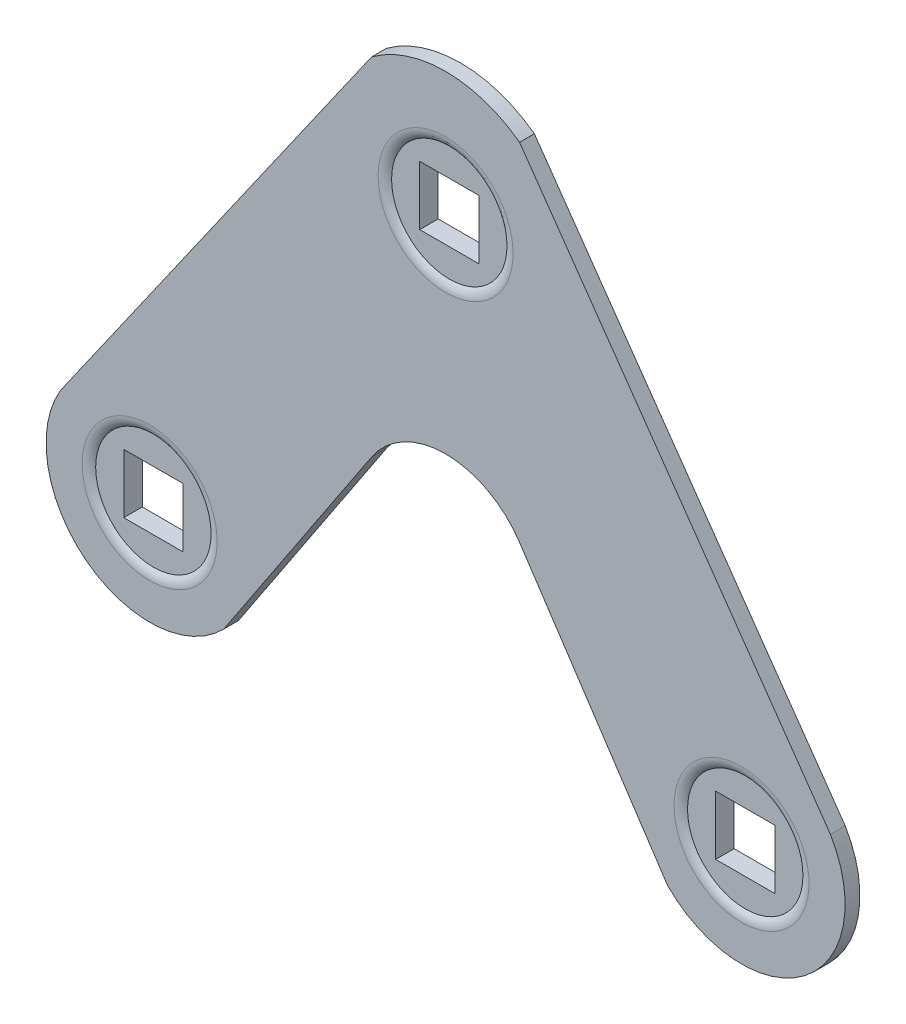
ISO-10303-21;
HEADER;
FILE_DESCRIPTION(('STEP AP214'),'2;1');
FILE_NAME('part.step','',(''),(''),'','','');
FILE_SCHEMA(('AUTOMOTIVE_DESIGN { 1 0 10303 214 1 1 1 1 }'));
ENDSEC;
DATA;
#1=APPLICATION_CONTEXT('core data for automotive mechanical design processes');
#2=APPLICATION_PROTOCOL_DEFINITION('international standard','automotive_design',2000,#1);
#3=PRODUCT_CONTEXT('',#1,'mechanical');
#4=PRODUCT('Part','Part','',(#3));
#5=PRODUCT_RELATED_PRODUCT_CATEGORY('part','',(#4));
#6=PRODUCT_DEFINITION_FORMATION('','',#4);
#7=PRODUCT_DEFINITION_CONTEXT('part definition',#1,'design');
#8=PRODUCT_DEFINITION('design','',#6,#7);
#9=PRODUCT_DEFINITION_SHAPE('','',#8);
#10=(LENGTH_UNIT() NAMED_UNIT(*) SI_UNIT(.MILLI.,.METRE.));
#11=(NAMED_UNIT(*) PLANE_ANGLE_UNIT() SI_UNIT($,.RADIAN.));
#12=(NAMED_UNIT(*) SI_UNIT($,.STERADIAN.) SOLID_ANGLE_UNIT());
#13=UNCERTAINTY_MEASURE_WITH_UNIT(LENGTH_MEASURE(1.E-05),#10,'distance_accuracy_value','');
#14=(GEOMETRIC_REPRESENTATION_CONTEXT(3) GLOBAL_UNCERTAINTY_ASSIGNED_CONTEXT((#13)) GLOBAL_UNIT_ASSIGNED_CONTEXT((#10,
#11,#12)) REPRESENTATION_CONTEXT('',''));
#15=CARTESIAN_POINT('',(0.,0.,0.));
#16=DIRECTION('',(0.,0.,1.));
#17=DIRECTION('',(1.,0.,0.));
#18=AXIS2_PLACEMENT_3D('',#15,#16,#17);
#19=CARTESIAN_POINT('',(0.,9.,0.));
#20=DIRECTION('',(0.,0.,-1.));
#21=DIRECTION('',(-1.,0.,0.));
#22=AXIS2_PLACEMENT_3D('',#19,#20,#21);
#23=PLANE('',#22);
#24=CARTESIAN_POINT('',(20.,2.14003704703357,0.));
#25=DIRECTION('',(0.,0.,-1.));
#26=DIRECTION('',(-1.,0.,0.));
#27=AXIS2_PLACEMENT_3D('',#24,#25,#26);
#28=CIRCLE('',#27,4.25);
#29=CARTESIAN_POINT('',(15.75,2.14003704703357,0.));
#30=VERTEX_POINT('',#29);
#31=EDGE_CURVE('E235',#30,#30,#28,.T.);
#32=ORIENTED_EDGE('',*,*,#31,.F.);
#33=EDGE_LOOP('',(#32));
#34=FACE_BOUND('',#33,.T.);
#35=CARTESIAN_POINT('',(0.,9.,0.));
#36=DIRECTION('',(0.,0.,-1.));
#37=DIRECTION('',(-1.,0.,0.));
#38=AXIS2_PLACEMENT_3D('',#35,#36,#37);
#39=CIRCLE('',#38,6.);
#40=CARTESIAN_POINT('',(-5.,12.3166247903554,0.));
#41=VERTEX_POINT('',#40);
#42=CARTESIAN_POINT('',(5.,12.3166247903554,0.));
#43=VERTEX_POINT('',#42);
#44=EDGE_CURVE('E313',#41,#43,#39,.T.);
#45=ORIENTED_EDGE('',*,*,#44,.F.);
#46=DIRECTION('',(0.552770798392567,0.833333333333333,0.));
#47=VECTOR('',#46,1.);
#48=CARTESIAN_POINT('',(-5.,12.3166247903554,0.));
#49=LINE('',#48,#47);
#50=CARTESIAN_POINT('',(-15.,-2.75894243853278,0.));
#51=VERTEX_POINT('',#50);
#52=EDGE_CURVE('E326',#51,#41,#49,.T.);
#53=ORIENTED_EDGE('',*,*,#52,.F.);
#54=CARTESIAN_POINT('',(-20.,2.14003704703357,0.));
#55=DIRECTION('',(0.,0.,1.));
#56=DIRECTION('',(-1.,0.,0.));
#57=AXIS2_PLACEMENT_3D('',#54,#55,#56);
#58=CIRCLE('',#57,7.);
#59=CARTESIAN_POINT('',(-26.0062261462914,5.73520706799309,0.));
#60=VERTEX_POINT('',#59);
#61=EDGE_CURVE('E366',#60,#51,#58,.T.);
#62=ORIENTED_EDGE('',*,*,#61,.F.);
#63=DIRECTION('',(-0.573576436351047,-0.819152044288991,0.));
#64=VECTOR('',#63,1.);
#65=CARTESIAN_POINT('',(-5.,35.7352070679931,0.));
#66=LINE('',#65,#64);
#67=CARTESIAN_POINT('',(-5.,35.7352070679931,0.));
#68=VERTEX_POINT('',#67);
#69=EDGE_CURVE('E363',#68,#60,#66,.T.);
#70=ORIENTED_EDGE('',*,*,#69,.F.);
#71=CARTESIAN_POINT('',(0.,29.,0.));
#72=DIRECTION('',(0.,0.,1.));
#73=DIRECTION('',(-1.,0.,0.));
#74=AXIS2_PLACEMENT_3D('',#71,#72,#73);
#75=CIRCLE('',#74,8.3882664626694);
#76=CARTESIAN_POINT('',(5.,35.7352070679931,0.));
#77=VERTEX_POINT('',#76);
#78=EDGE_CURVE('E360',#77,#68,#75,.T.);
#79=ORIENTED_EDGE('',*,*,#78,.F.);
#80=DIRECTION('',(-0.573576436351047,0.819152044288991,0.));
#81=VECTOR('',#80,1.);
#82=CARTESIAN_POINT('',(5.,35.7352070679931,0.));
#83=LINE('',#82,#81);
#84=CARTESIAN_POINT('',(26.0062261462914,5.73520706799309,0.));
#85=VERTEX_POINT('',#84);
#86=EDGE_CURVE('E357',#85,#77,#83,.T.);
#87=ORIENTED_EDGE('',*,*,#86,.F.);
#88=CARTESIAN_POINT('',(20.,2.14003704703357,0.));
#89=DIRECTION('',(0.,0.,1.));
#90=DIRECTION('',(1.,0.,0.));
#91=AXIS2_PLACEMENT_3D('',#88,#89,#90);
#92=CIRCLE('',#91,7.);
#93=CARTESIAN_POINT('',(15.,-2.75894243853278,0.));
#94=VERTEX_POINT('',#93);
#95=EDGE_CURVE('E354',#94,#85,#92,.T.);
#96=ORIENTED_EDGE('',*,*,#95,.F.);
#97=DIRECTION('',(0.552770798392567,-0.833333333333333,0.));
#98=VECTOR('',#97,1.);
#99=CARTESIAN_POINT('',(5.,12.3166247903554,0.));
#100=LINE('',#99,#98);
#101=EDGE_CURVE('E351',#43,#94,#100,.T.);
#102=ORIENTED_EDGE('',*,*,#101,.F.);
#103=EDGE_LOOP('',(#45,#53,#62,#70,#79,#87,#96,#102));
#104=FACE_BOUND('',#103,.T.);
#105=CARTESIAN_POINT('',(0.,29.,0.));
#106=DIRECTION('',(0.,0.,-1.));
#107=DIRECTION('',(-1.,0.,0.));
#108=AXIS2_PLACEMENT_3D('',#105,#106,#107);
#109=CIRCLE('',#108,4.25);
#110=CARTESIAN_POINT('',(-4.25,29.,0.));
#111=VERTEX_POINT('',#110);
#112=EDGE_CURVE('E208',#111,#111,#109,.T.);
#113=ORIENTED_EDGE('',*,*,#112,.F.);
#114=EDGE_LOOP('',(#113));
#115=FACE_BOUND('',#114,.T.);
#116=CARTESIAN_POINT('',(-20.,2.14003704703357,0.));
#117=DIRECTION('',(0.,0.,-1.));
#118=DIRECTION('',(-1.,0.,0.));
#119=AXIS2_PLACEMENT_3D('',#116,#117,#118);
#120=CIRCLE('',#119,4.25);
#121=CARTESIAN_POINT('',(-24.25,2.14003704703357,0.));
#122=VERTEX_POINT('',#121);
#123=EDGE_CURVE('E224',#122,#122,#120,.T.);
#124=ORIENTED_EDGE('',*,*,#123,.F.);
#125=EDGE_LOOP('',(#124));
#126=FACE_BOUND('',#125,.T.);
#127=ADVANCED_FACE('F56',(#34,#104,#115,#126),#23,.T.);
#128=CARTESIAN_POINT('',(0.,9.,1.));
#129=DIRECTION('',(0.,0.,-1.));
#130=DIRECTION('',(-1.,0.,0.));
#131=AXIS2_PLACEMENT_3D('',#128,#129,#130);
#132=CYLINDRICAL_SURFACE('',#131,6.);
#133=ORIENTED_EDGE('',*,*,#44,.T.);
#134=DIRECTION('',(0.,0.,-1.));
#135=VECTOR('',#134,1.);
#136=CARTESIAN_POINT('',(5.,12.3166247903554,1.));
#137=LINE('',#136,#135);
#138=CARTESIAN_POINT('',(5.,12.3166247903554,1.));
#139=VERTEX_POINT('',#138);
#140=EDGE_CURVE('E398',#139,#43,#137,.T.);
#141=ORIENTED_EDGE('',*,*,#140,.F.);
#142=CARTESIAN_POINT('',(0.,9.,1.));
#143=DIRECTION('',(0.,0.,-1.));
#144=DIRECTION('',(-1.,0.,0.));
#145=AXIS2_PLACEMENT_3D('',#142,#143,#144);
#146=CIRCLE('',#145,6.);
#147=CARTESIAN_POINT('',(-5.,12.3166247903554,1.));
#148=VERTEX_POINT('',#147);
#149=EDGE_CURVE('E321',#148,#139,#146,.T.);
#150=ORIENTED_EDGE('',*,*,#149,.F.);
#151=DIRECTION('',(0.,0.,-1.));
#152=VECTOR('',#151,1.);
#153=CARTESIAN_POINT('',(-5.,12.3166247903554,1.));
#154=LINE('',#153,#152);
#155=EDGE_CURVE('E347',#148,#41,#154,.T.);
#156=ORIENTED_EDGE('',*,*,#155,.T.);
#157=EDGE_LOOP('',(#133,#141,#150,#156));
#158=FACE_BOUND('',#157,.T.);
#159=ADVANCED_FACE('F470',(#158),#132,.F.);
#160=CARTESIAN_POINT('',(5.,12.3166247903554,1.));
#161=DIRECTION('',(0.833333333333333,0.552770798392567,0.));
#162=DIRECTION('',(-0.552770798392567,0.833333333333333,0.));
#163=AXIS2_PLACEMENT_3D('',#160,#161,#162);
#164=PLANE('',#163);
#165=ORIENTED_EDGE('',*,*,#101,.T.);
#166=DIRECTION('',(0.,0.,-1.));
#167=VECTOR('',#166,1.);
#168=CARTESIAN_POINT('',(15.,-2.75894243853278,1.));
#169=LINE('',#168,#167);
#170=CARTESIAN_POINT('',(15.,-2.75894243853278,1.));
#171=VERTEX_POINT('',#170);
#172=EDGE_CURVE('E394',#171,#94,#169,.T.);
#173=ORIENTED_EDGE('',*,*,#172,.F.);
#174=DIRECTION('',(0.552770798392567,-0.833333333333333,0.));
#175=VECTOR('',#174,1.);
#176=CARTESIAN_POINT('',(5.,12.3166247903554,1.));
#177=LINE('',#176,#175);
#178=EDGE_CURVE('E325',#139,#171,#177,.T.);
#179=ORIENTED_EDGE('',*,*,#178,.F.);
#180=ORIENTED_EDGE('',*,*,#140,.T.);
#181=EDGE_LOOP('',(#165,#173,#179,#180));
#182=FACE_BOUND('',#181,.T.);
#183=ADVANCED_FACE('F476',(#182),#164,.F.);
#184=CARTESIAN_POINT('',(20.,2.14003704703357,1.));
#185=DIRECTION('',(0.,0.,-1.));
#186=DIRECTION('',(-1.,0.,0.));
#187=AXIS2_PLACEMENT_3D('',#184,#185,#186);
#188=CYLINDRICAL_SURFACE('',#187,7.);
#189=ORIENTED_EDGE('',*,*,#95,.T.);
#190=DIRECTION('',(0.,0.,-1.));
#191=VECTOR('',#190,1.);
#192=CARTESIAN_POINT('',(26.0062261462914,5.73520706799309,1.));
#193=LINE('',#192,#191);
#194=CARTESIAN_POINT('',(26.0062261462914,5.73520706799309,1.));
#195=VERTEX_POINT('',#194);
#196=EDGE_CURVE('E390',#195,#85,#193,.T.);
#197=ORIENTED_EDGE('',*,*,#196,.F.);
#198=CARTESIAN_POINT('',(20.,2.14003704703357,1.));
#199=DIRECTION('',(0.,0.,1.));
#200=DIRECTION('',(1.,0.,0.));
#201=AXIS2_PLACEMENT_3D('',#198,#199,#200);
#202=CIRCLE('',#201,7.);
#203=EDGE_CURVE('E329',#171,#195,#202,.T.);
#204=ORIENTED_EDGE('',*,*,#203,.F.);
#205=ORIENTED_EDGE('',*,*,#172,.T.);
#206=EDGE_LOOP('',(#189,#197,#204,#205));
#207=FACE_BOUND('',#206,.T.);
#208=ADVANCED_FACE('F504',(#207),#188,.T.);
#209=CARTESIAN_POINT('',(5.,35.7352070679931,1.));
#210=DIRECTION('',(-0.819152044288991,-0.573576436351047,0.));
#211=DIRECTION('',(0.573576436351047,-0.819152044288991,0.));
#212=AXIS2_PLACEMENT_3D('',#209,#210,#211);
#213=PLANE('',#212);
#214=ORIENTED_EDGE('',*,*,#86,.T.);
#215=DIRECTION('',(0.,0.,-1.));
#216=VECTOR('',#215,1.);
#217=CARTESIAN_POINT('',(5.,35.7352070679931,1.));
#218=LINE('',#217,#216);
#219=CARTESIAN_POINT('',(5.,35.7352070679931,1.));
#220=VERTEX_POINT('',#219);
#221=EDGE_CURVE('E386',#220,#77,#218,.T.);
#222=ORIENTED_EDGE('',*,*,#221,.F.);
#223=DIRECTION('',(-0.573576436351047,0.819152044288991,0.));
#224=VECTOR('',#223,1.);
#225=CARTESIAN_POINT('',(5.,35.7352070679931,1.));
#226=LINE('',#225,#224);
#227=EDGE_CURVE('E332',#195,#220,#226,.T.);
#228=ORIENTED_EDGE('',*,*,#227,.F.);
#229=ORIENTED_EDGE('',*,*,#196,.T.);
#230=EDGE_LOOP('',(#214,#222,#228,#229));
#231=FACE_BOUND('',#230,.T.);
#232=ADVANCED_FACE('F500',(#231),#213,.F.);
#233=CARTESIAN_POINT('',(0.,29.,1.));
#234=DIRECTION('',(0.,0.,-1.));
#235=DIRECTION('',(-1.,0.,0.));
#236=AXIS2_PLACEMENT_3D('',#233,#234,#235);
#237=CYLINDRICAL_SURFACE('',#236,8.3882664626694);
#238=ORIENTED_EDGE('',*,*,#78,.T.);
#239=DIRECTION('',(0.,0.,-1.));
#240=VECTOR('',#239,1.);
#241=CARTESIAN_POINT('',(-5.,35.7352070679931,1.));
#242=LINE('',#241,#240);
#243=CARTESIAN_POINT('',(-5.,35.7352070679931,1.));
#244=VERTEX_POINT('',#243);
#245=EDGE_CURVE('E382',#244,#68,#242,.T.);
#246=ORIENTED_EDGE('',*,*,#245,.F.);
#247=CARTESIAN_POINT('',(0.,29.,1.));
#248=DIRECTION('',(0.,0.,1.));
#249=DIRECTION('',(-1.,0.,0.));
#250=AXIS2_PLACEMENT_3D('',#247,#248,#249);
#251=CIRCLE('',#250,8.3882664626694);
#252=EDGE_CURVE('E335',#220,#244,#251,.T.);
#253=ORIENTED_EDGE('',*,*,#252,.F.);
#254=ORIENTED_EDGE('',*,*,#221,.T.);
#255=EDGE_LOOP('',(#238,#246,#253,#254));
#256=FACE_BOUND('',#255,.T.);
#257=ADVANCED_FACE('F496',(#256),#237,.T.);
#258=CARTESIAN_POINT('',(-5.,35.7352070679931,1.));
#259=DIRECTION('',(0.819152044288991,-0.573576436351047,0.));
#260=DIRECTION('',(0.573576436351047,0.819152044288991,0.));
#261=AXIS2_PLACEMENT_3D('',#258,#259,#260);
#262=PLANE('',#261);
#263=ORIENTED_EDGE('',*,*,#69,.T.);
#264=DIRECTION('',(0.,0.,-1.));
#265=VECTOR('',#264,1.);
#266=CARTESIAN_POINT('',(-26.0062261462914,5.73520706799309,1.));
#267=LINE('',#266,#265);
#268=CARTESIAN_POINT('',(-26.0062261462914,5.73520706799309,1.));
#269=VERTEX_POINT('',#268);
#270=EDGE_CURVE('E378',#269,#60,#267,.T.);
#271=ORIENTED_EDGE('',*,*,#270,.F.);
#272=DIRECTION('',(-0.573576436351047,-0.819152044288991,0.));
#273=VECTOR('',#272,1.);
#274=CARTESIAN_POINT('',(-5.,35.7352070679931,1.));
#275=LINE('',#274,#273);
#276=EDGE_CURVE('E338',#244,#269,#275,.T.);
#277=ORIENTED_EDGE('',*,*,#276,.F.);
#278=ORIENTED_EDGE('',*,*,#245,.T.);
#279=EDGE_LOOP('',(#263,#271,#277,#278));
#280=FACE_BOUND('',#279,.T.);
#281=ADVANCED_FACE('F492',(#280),#262,.F.);
#282=CARTESIAN_POINT('',(-20.,2.14003704703357,1.));
#283=DIRECTION('',(0.,0.,-1.));
#284=DIRECTION('',(-1.,0.,0.));
#285=AXIS2_PLACEMENT_3D('',#282,#283,#284);
#286=CYLINDRICAL_SURFACE('',#285,7.);
#287=ORIENTED_EDGE('',*,*,#61,.T.);
#288=DIRECTION('',(0.,0.,-1.));
#289=VECTOR('',#288,1.);
#290=CARTESIAN_POINT('',(-15.,-2.75894243853278,1.));
#291=LINE('',#290,#289);
#292=CARTESIAN_POINT('',(-15.,-2.75894243853278,1.));
#293=VERTEX_POINT('',#292);
#294=EDGE_CURVE('E374',#293,#51,#291,.T.);
#295=ORIENTED_EDGE('',*,*,#294,.F.);
#296=CARTESIAN_POINT('',(-20.,2.14003704703357,1.));
#297=DIRECTION('',(0.,0.,1.));
#298=DIRECTION('',(-1.,0.,0.));
#299=AXIS2_PLACEMENT_3D('',#296,#297,#298);
#300=CIRCLE('',#299,7.);
#301=EDGE_CURVE('E341',#269,#293,#300,.T.);
#302=ORIENTED_EDGE('',*,*,#301,.F.);
#303=ORIENTED_EDGE('',*,*,#270,.T.);
#304=EDGE_LOOP('',(#287,#295,#302,#303));
#305=FACE_BOUND('',#304,.T.);
#306=ADVANCED_FACE('F488',(#305),#286,.T.);
#307=CARTESIAN_POINT('',(-5.,12.3166247903554,1.));
#308=DIRECTION('',(-0.833333333333333,0.552770798392567,0.));
#309=DIRECTION('',(-0.552770798392567,-0.833333333333333,0.));
#310=AXIS2_PLACEMENT_3D('',#307,#308,#309);
#311=PLANE('',#310);
#312=ORIENTED_EDGE('',*,*,#52,.T.);
#313=ORIENTED_EDGE('',*,*,#155,.F.);
#314=DIRECTION('',(0.552770798392567,0.833333333333333,0.));
#315=VECTOR('',#314,1.);
#316=CARTESIAN_POINT('',(-5.,12.3166247903554,1.));
#317=LINE('',#316,#315);
#318=EDGE_CURVE('E344',#293,#148,#317,.T.);
#319=ORIENTED_EDGE('',*,*,#318,.F.);
#320=ORIENTED_EDGE('',*,*,#294,.T.);
#321=EDGE_LOOP('',(#312,#313,#319,#320));
#322=FACE_BOUND('',#321,.T.);
#323=ADVANCED_FACE('F485',(#322),#311,.F.);
#324=CARTESIAN_POINT('',(0.,9.,1.));
#325=DIRECTION('',(0.,0.,-1.));
#326=DIRECTION('',(-1.,0.,0.));
#327=AXIS2_PLACEMENT_3D('',#324,#325,#326);
#328=PLANE('',#327);
#329=CARTESIAN_POINT('',(-20.,2.14003704703357,1.));
#330=DIRECTION('',(0.,0.,-1.));
#331=DIRECTION('',(-1.,0.,0.));
#332=AXIS2_PLACEMENT_3D('',#329,#330,#331);
#333=CIRCLE('',#332,4.56143782776615);
#334=CARTESIAN_POINT('',(-24.5614378277661,2.14003704703357,1.));
#335=VERTEX_POINT('',#334);
#336=EDGE_CURVE('E410',#335,#335,#333,.T.);
#337=ORIENTED_EDGE('',*,*,#336,.T.);
#338=EDGE_LOOP('',(#337));
#339=FACE_BOUND('',#338,.T.);
#340=CARTESIAN_POINT('',(20.,2.14003704703357,1.));
#341=DIRECTION('',(0.,0.,-1.));
#342=DIRECTION('',(-1.,0.,0.));
#343=AXIS2_PLACEMENT_3D('',#340,#341,#342);
#344=CIRCLE('',#343,4.56143782776615);
#345=CARTESIAN_POINT('',(15.4385621722339,2.14003704703357,1.));
#346=VERTEX_POINT('',#345);
#347=EDGE_CURVE('E406',#346,#346,#344,.T.);
#348=ORIENTED_EDGE('',*,*,#347,.T.);
#349=EDGE_LOOP('',(#348));
#350=FACE_BOUND('',#349,.T.);
#351=CARTESIAN_POINT('',(0.,29.,1.));
#352=DIRECTION('',(0.,0.,-1.));
#353=DIRECTION('',(-1.,0.,0.));
#354=AXIS2_PLACEMENT_3D('',#351,#352,#353);
#355=CIRCLE('',#354,4.56143782776615);
#356=CARTESIAN_POINT('',(-4.56143782776615,29.,1.));
#357=VERTEX_POINT('',#356);
#358=EDGE_CURVE('E402',#357,#357,#355,.T.);
#359=ORIENTED_EDGE('',*,*,#358,.T.);
#360=EDGE_LOOP('',(#359));
#361=FACE_BOUND('',#360,.T.);
#362=ORIENTED_EDGE('',*,*,#149,.T.);
#363=ORIENTED_EDGE('',*,*,#178,.T.);
#364=ORIENTED_EDGE('',*,*,#203,.T.);
#365=ORIENTED_EDGE('',*,*,#227,.T.);
#366=ORIENTED_EDGE('',*,*,#252,.T.);
#367=ORIENTED_EDGE('',*,*,#276,.T.);
#368=ORIENTED_EDGE('',*,*,#301,.T.);
#369=ORIENTED_EDGE('',*,*,#318,.T.);
#370=EDGE_LOOP('',(#362,#363,#364,#365,#366,#367,#368,#369));
#371=FACE_BOUND('',#370,.T.);
#372=ADVANCED_FACE('F483',(#339,#350,#361,#371),#328,.F.);
#373=CARTESIAN_POINT('',(0.,29.,0.75));
#374=DIRECTION('',(0.,0.,1.));
#375=DIRECTION('',(1.,0.,0.));
#376=AXIS2_PLACEMENT_3D('',#373,#374,#375);
#377=PLANE('',#376);
#378=DIRECTION('',(0.,1.,0.));
#379=VECTOR('',#378,1.);
#380=CARTESIAN_POINT('',(2.,29.,0.75));
#381=LINE('',#380,#379);
#382=CARTESIAN_POINT('',(2.,27.,0.75));
#383=VERTEX_POINT('',#382);
#384=CARTESIAN_POINT('',(2.,31.,0.75));
#385=VERTEX_POINT('',#384);
#386=EDGE_CURVE('E446',#383,#385,#381,.T.);
#387=ORIENTED_EDGE('',*,*,#386,.F.);
#388=DIRECTION('',(1.,0.,0.));
#389=VECTOR('',#388,1.);
#390=CARTESIAN_POINT('',(0.,27.,0.75));
#391=LINE('',#390,#389);
#392=CARTESIAN_POINT('',(-2.,27.,0.75));
#393=VERTEX_POINT('',#392);
#394=EDGE_CURVE('E443',#393,#383,#391,.T.);
#395=ORIENTED_EDGE('',*,*,#394,.F.);
#396=DIRECTION('',(0.,-1.,0.));
#397=VECTOR('',#396,1.);
#398=CARTESIAN_POINT('',(-2.,29.,0.75));
#399=LINE('',#398,#397);
#400=CARTESIAN_POINT('',(-2.,31.,0.75));
#401=VERTEX_POINT('',#400);
#402=EDGE_CURVE('E440',#401,#393,#399,.T.);
#403=ORIENTED_EDGE('',*,*,#402,.F.);
#404=DIRECTION('',(-1.,0.,0.));
#405=VECTOR('',#404,1.);
#406=CARTESIAN_POINT('',(0.,31.,0.75));
#407=LINE('',#406,#405);
#408=EDGE_CURVE('E437',#385,#401,#407,.T.);
#409=ORIENTED_EDGE('',*,*,#408,.F.);
#410=EDGE_LOOP('',(#387,#395,#403,#409));
#411=FACE_BOUND('',#410,.T.);
#412=CARTESIAN_POINT('',(0.,29.,0.75));
#413=DIRECTION('',(0.,0.,1.));
#414=DIRECTION('',(1.,0.,0.));
#415=AXIS2_PLACEMENT_3D('',#412,#413,#414);
#416=CIRCLE('',#415,3.9);
#417=CARTESIAN_POINT('',(3.9,29.,0.75));
#418=VERTEX_POINT('',#417);
#419=EDGE_CURVE('E276',#418,#418,#416,.T.);
#420=ORIENTED_EDGE('',*,*,#419,.T.);
#421=EDGE_LOOP('',(#420));
#422=FACE_BOUND('',#421,.T.);
#423=ADVANCED_FACE('F532',(#411,#422),#377,.T.);
#424=CARTESIAN_POINT('',(20.,2.14003704703357,0.75));
#425=DIRECTION('',(0.,0.,1.));
#426=DIRECTION('',(1.,0.,0.));
#427=AXIS2_PLACEMENT_3D('',#424,#425,#426);
#428=PLANE('',#427);
#429=DIRECTION('',(0.,1.,0.));
#430=VECTOR('',#429,1.);
#431=CARTESIAN_POINT('',(22.,2.14003704703357,0.75));
#432=LINE('',#431,#430);
#433=CARTESIAN_POINT('',(22.,0.140037047033571,0.75));
#434=VERTEX_POINT('',#433);
#435=CARTESIAN_POINT('',(22.,4.14003704703357,0.75));
#436=VERTEX_POINT('',#435);
#437=EDGE_CURVE('E434',#434,#436,#432,.T.);
#438=ORIENTED_EDGE('',*,*,#437,.F.);
#439=DIRECTION('',(1.,0.,0.));
#440=VECTOR('',#439,1.);
#441=CARTESIAN_POINT('',(20.,0.140037047033571,0.75));
#442=LINE('',#441,#440);
#443=CARTESIAN_POINT('',(18.,0.140037047033571,0.75));
#444=VERTEX_POINT('',#443);
#445=EDGE_CURVE('E431',#444,#434,#442,.T.);
#446=ORIENTED_EDGE('',*,*,#445,.F.);
#447=DIRECTION('',(0.,-1.,0.));
#448=VECTOR('',#447,1.);
#449=CARTESIAN_POINT('',(18.,2.14003704703357,0.75));
#450=LINE('',#449,#448);
#451=CARTESIAN_POINT('',(18.,4.14003704703357,0.75));
#452=VERTEX_POINT('',#451);
#453=EDGE_CURVE('E428',#452,#444,#450,.T.);
#454=ORIENTED_EDGE('',*,*,#453,.F.);
#455=DIRECTION('',(-1.,0.,0.));
#456=VECTOR('',#455,1.);
#457=CARTESIAN_POINT('',(20.,4.14003704703357,0.75));
#458=LINE('',#457,#456);
#459=EDGE_CURVE('E425',#436,#452,#458,.T.);
#460=ORIENTED_EDGE('',*,*,#459,.F.);
#461=EDGE_LOOP('',(#438,#446,#454,#460));
#462=FACE_BOUND('',#461,.T.);
#463=CARTESIAN_POINT('',(20.,2.14003704703357,0.75));
#464=DIRECTION('',(0.,0.,1.));
#465=DIRECTION('',(1.,0.,0.));
#466=AXIS2_PLACEMENT_3D('',#463,#464,#465);
#467=CIRCLE('',#466,3.9);
#468=CARTESIAN_POINT('',(23.9,2.14003704703357,0.75));
#469=VERTEX_POINT('',#468);
#470=EDGE_CURVE('E314',#469,#469,#467,.T.);
#471=ORIENTED_EDGE('',*,*,#470,.T.);
#472=EDGE_LOOP('',(#471));
#473=FACE_BOUND('',#472,.T.);
#474=ADVANCED_FACE('F534',(#462,#473),#428,.T.);
#475=CARTESIAN_POINT('',(-20.,2.14003704703357,0.75));
#476=DIRECTION('',(0.,0.,1.));
#477=DIRECTION('',(1.,0.,0.));
#478=AXIS2_PLACEMENT_3D('',#475,#476,#477);
#479=PLANE('',#478);
#480=DIRECTION('',(0.,1.,0.));
#481=VECTOR('',#480,1.);
#482=CARTESIAN_POINT('',(-18.,2.14003704703357,0.75));
#483=LINE('',#482,#481);
#484=CARTESIAN_POINT('',(-18.,0.140037047033573,0.75));
#485=VERTEX_POINT('',#484);
#486=CARTESIAN_POINT('',(-18.,4.14003704703357,0.75));
#487=VERTEX_POINT('',#486);
#488=EDGE_CURVE('E422',#485,#487,#483,.T.);
#489=ORIENTED_EDGE('',*,*,#488,.F.);
#490=DIRECTION('',(1.,0.,0.));
#491=VECTOR('',#490,1.);
#492=CARTESIAN_POINT('',(-20.,0.140037047033573,0.75));
#493=LINE('',#492,#491);
#494=CARTESIAN_POINT('',(-22.,0.140037047033573,0.75));
#495=VERTEX_POINT('',#494);
#496=EDGE_CURVE('E202',#495,#485,#493,.T.);
#497=ORIENTED_EDGE('',*,*,#496,.F.);
#498=DIRECTION('',(0.,-1.,0.));
#499=VECTOR('',#498,1.);
#500=CARTESIAN_POINT('',(-22.,2.14003704703357,0.75));
#501=LINE('',#500,#499);
#502=CARTESIAN_POINT('',(-22.,4.14003704703357,0.75));
#503=VERTEX_POINT('',#502);
#504=EDGE_CURVE('E417',#503,#495,#501,.T.);
#505=ORIENTED_EDGE('',*,*,#504,.F.);
#506=DIRECTION('',(-1.,0.,0.));
#507=VECTOR('',#506,1.);
#508=CARTESIAN_POINT('',(-20.,4.14003704703357,0.75));
#509=LINE('',#508,#507);
#510=EDGE_CURVE('E414',#487,#503,#509,.T.);
#511=ORIENTED_EDGE('',*,*,#510,.F.);
#512=EDGE_LOOP('',(#489,#497,#505,#511));
#513=FACE_BOUND('',#512,.T.);
#514=CARTESIAN_POINT('',(-20.,2.14003704703357,0.75));
#515=DIRECTION('',(0.,0.,1.));
#516=DIRECTION('',(1.,0.,0.));
#517=AXIS2_PLACEMENT_3D('',#514,#515,#516);
#518=CIRCLE('',#517,3.9);
#519=CARTESIAN_POINT('',(-16.1,2.14003704703357,0.75));
#520=VERTEX_POINT('',#519);
#521=EDGE_CURVE('E309',#520,#520,#518,.T.);
#522=ORIENTED_EDGE('',*,*,#521,.T.);
#523=EDGE_LOOP('',(#522));
#524=FACE_BOUND('',#523,.T.);
#525=ADVANCED_FACE('F516',(#513,#524),#479,.T.);
#526=CARTESIAN_POINT('',(-20.,2.14003704703357,0.));
#527=DIRECTION('',(0.,0.,-1.));
#528=DIRECTION('',(-1.,0.,0.));
#529=AXIS2_PLACEMENT_3D('',#526,#527,#528);
#530=TOROIDAL_SURFACE('',#529,4.56143782776615,1.);
#531=ORIENTED_EDGE('',*,*,#336,.F.);
#532=EDGE_LOOP('',(#531));
#533=FACE_BOUND('',#532,.T.);
#534=ORIENTED_EDGE('',*,*,#521,.F.);
#535=EDGE_LOOP('',(#534));
#536=FACE_BOUND('',#535,.T.);
#537=ADVANCED_FACE('F512',(#533,#536),#530,.T.);
#538=CARTESIAN_POINT('',(20.,2.14003704703357,0.));
#539=DIRECTION('',(0.,0.,-1.));
#540=DIRECTION('',(-1.,0.,0.));
#541=AXIS2_PLACEMENT_3D('',#538,#539,#540);
#542=TOROIDAL_SURFACE('',#541,4.56143782776615,1.);
#543=ORIENTED_EDGE('',*,*,#347,.F.);
#544=EDGE_LOOP('',(#543));
#545=FACE_BOUND('',#544,.T.);
#546=ORIENTED_EDGE('',*,*,#470,.F.);
#547=EDGE_LOOP('',(#546));
#548=FACE_BOUND('',#547,.T.);
#549=ADVANCED_FACE('F515',(#545,#548),#542,.T.);
#550=CARTESIAN_POINT('',(0.,29.,0.));
#551=DIRECTION('',(0.,0.,-1.));
#552=DIRECTION('',(-1.,0.,0.));
#553=AXIS2_PLACEMENT_3D('',#550,#551,#552);
#554=TOROIDAL_SURFACE('',#553,4.56143782776615,1.);
#555=ORIENTED_EDGE('',*,*,#358,.F.);
#556=EDGE_LOOP('',(#555));
#557=FACE_BOUND('',#556,.T.);
#558=ORIENTED_EDGE('',*,*,#419,.F.);
#559=EDGE_LOOP('',(#558));
#560=FACE_BOUND('',#559,.T.);
#561=ADVANCED_FACE('F520',(#557,#560),#554,.T.);
#562=CARTESIAN_POINT('',(-18.,4.14003704703357,-1.));
#563=DIRECTION('',(1.,0.,0.));
#564=DIRECTION('',(0.,0.,-1.));
#565=AXIS2_PLACEMENT_3D('',#562,#563,#564);
#566=PLANE('',#565);
#567=DIRECTION('',(0.,0.,1.));
#568=VECTOR('',#567,1.);
#569=CARTESIAN_POINT('',(-18.,4.14003704703357,-1.));
#570=LINE('',#569,#568);
#571=CARTESIAN_POINT('',(-18.,4.14003704703357,-0.5));
#572=VERTEX_POINT('',#571);
#573=EDGE_CURVE('E213',#572,#487,#570,.T.);
#574=ORIENTED_EDGE('',*,*,#573,.F.);
#575=DIRECTION('',(0.,-1.,0.));
#576=VECTOR('',#575,1.);
#577=CARTESIAN_POINT('',(-18.,4.14003704703357,-0.5));
#578=LINE('',#577,#576);
#579=CARTESIAN_POINT('',(-18.,0.140037047033573,-0.5));
#580=VERTEX_POINT('',#579);
#581=EDGE_CURVE('E211',#572,#580,#578,.T.);
#582=ORIENTED_EDGE('',*,*,#581,.T.);
#583=DIRECTION('',(0.,0.,1.));
#584=VECTOR('',#583,1.);
#585=CARTESIAN_POINT('',(-18.,0.140037047033573,-1.));
#586=LINE('',#585,#584);
#587=EDGE_CURVE('E194',#580,#485,#586,.T.);
#588=ORIENTED_EDGE('',*,*,#587,.T.);
#589=ORIENTED_EDGE('',*,*,#488,.T.);
#590=EDGE_LOOP('',(#574,#582,#588,#589));
#591=FACE_BOUND('',#590,.T.);
#592=ADVANCED_FACE('F212',(#591),#566,.F.);
#593=CARTESIAN_POINT('',(-22.,0.140037047033573,-1.));
#594=DIRECTION('',(0.,-1.,0.));
#595=DIRECTION('',(0.,0.,-1.));
#596=AXIS2_PLACEMENT_3D('',#593,#594,#595);
#597=PLANE('',#596);
#598=ORIENTED_EDGE('',*,*,#587,.F.);
#599=DIRECTION('',(-1.,0.,0.));
#600=VECTOR('',#599,1.);
#601=CARTESIAN_POINT('',(-18.,0.140037047033573,-0.5));
#602=LINE('',#601,#600);
#603=CARTESIAN_POINT('',(-22.,0.140037047033573,-0.5));
#604=VERTEX_POINT('',#603);
#605=EDGE_CURVE('E199',#580,#604,#602,.T.);
#606=ORIENTED_EDGE('',*,*,#605,.T.);
#607=DIRECTION('',(0.,0.,1.));
#608=VECTOR('',#607,1.);
#609=CARTESIAN_POINT('',(-22.,0.140037047033573,-1.));
#610=LINE('',#609,#608);
#611=EDGE_CURVE('E207',#604,#495,#610,.T.);
#612=ORIENTED_EDGE('',*,*,#611,.T.);
#613=ORIENTED_EDGE('',*,*,#496,.T.);
#614=EDGE_LOOP('',(#598,#606,#612,#613));
#615=FACE_BOUND('',#614,.T.);
#616=ADVANCED_FACE('F196',(#615),#597,.F.);
#617=CARTESIAN_POINT('',(-22.,4.14003704703357,-1.));
#618=DIRECTION('',(-1.,0.,0.));
#619=DIRECTION('',(0.,0.,1.));
#620=AXIS2_PLACEMENT_3D('',#617,#618,#619);
#621=PLANE('',#620);
#622=ORIENTED_EDGE('',*,*,#611,.F.);
#623=DIRECTION('',(0.,1.,0.));
#624=VECTOR('',#623,1.);
#625=CARTESIAN_POINT('',(-22.,4.14003704703357,-0.5));
#626=LINE('',#625,#624);
#627=CARTESIAN_POINT('',(-22.,4.14003704703357,-0.5));
#628=VERTEX_POINT('',#627);
#629=EDGE_CURVE('E222',#604,#628,#626,.T.);
#630=ORIENTED_EDGE('',*,*,#629,.T.);
#631=DIRECTION('',(0.,0.,1.));
#632=VECTOR('',#631,1.);
#633=CARTESIAN_POINT('',(-22.,4.14003704703357,-1.));
#634=LINE('',#633,#632);
#635=EDGE_CURVE('E303',#628,#503,#634,.T.);
#636=ORIENTED_EDGE('',*,*,#635,.T.);
#637=ORIENTED_EDGE('',*,*,#504,.T.);
#638=EDGE_LOOP('',(#622,#630,#636,#637));
#639=FACE_BOUND('',#638,.T.);
#640=ADVANCED_FACE('F550',(#639),#621,.F.);
#641=CARTESIAN_POINT('',(-22.,4.14003704703357,-1.));
#642=DIRECTION('',(0.,1.,0.));
#643=DIRECTION('',(0.,0.,1.));
#644=AXIS2_PLACEMENT_3D('',#641,#642,#643);
#645=PLANE('',#644);
#646=ORIENTED_EDGE('',*,*,#635,.F.);
#647=DIRECTION('',(1.,0.,0.));
#648=VECTOR('',#647,1.);
#649=CARTESIAN_POINT('',(-18.,4.14003704703357,-0.5));
#650=LINE('',#649,#648);
#651=EDGE_CURVE('E218',#628,#572,#650,.T.);
#652=ORIENTED_EDGE('',*,*,#651,.T.);
#653=ORIENTED_EDGE('',*,*,#573,.T.);
#654=ORIENTED_EDGE('',*,*,#510,.T.);
#655=EDGE_LOOP('',(#646,#652,#653,#654));
#656=FACE_BOUND('',#655,.T.);
#657=ADVANCED_FACE('F553',(#656),#645,.F.);
#658=CARTESIAN_POINT('',(22.,4.14003704703357,-1.));
#659=DIRECTION('',(1.,0.,0.));
#660=DIRECTION('',(0.,0.,-1.));
#661=AXIS2_PLACEMENT_3D('',#658,#659,#660);
#662=PLANE('',#661);
#663=DIRECTION('',(0.,0.,1.));
#664=VECTOR('',#663,1.);
#665=CARTESIAN_POINT('',(22.,4.14003704703357,-1.));
#666=LINE('',#665,#664);
#667=CARTESIAN_POINT('',(22.,4.14003704703357,-0.5));
#668=VERTEX_POINT('',#667);
#669=EDGE_CURVE('E80',#668,#436,#666,.T.);
#670=ORIENTED_EDGE('',*,*,#669,.F.);
#671=DIRECTION('',(0.,-1.,0.));
#672=VECTOR('',#671,1.);
#673=CARTESIAN_POINT('',(22.,4.14003704703357,-0.5));
#674=LINE('',#673,#672);
#675=CARTESIAN_POINT('',(22.,0.140037047033571,-0.5));
#676=VERTEX_POINT('',#675);
#677=EDGE_CURVE('E243',#668,#676,#674,.T.);
#678=ORIENTED_EDGE('',*,*,#677,.T.);
#679=DIRECTION('',(0.,0.,1.));
#680=VECTOR('',#679,1.);
#681=CARTESIAN_POINT('',(22.,0.140037047033571,-1.));
#682=LINE('',#681,#680);
#683=EDGE_CURVE('E297',#676,#434,#682,.T.);
#684=ORIENTED_EDGE('',*,*,#683,.T.);
#685=ORIENTED_EDGE('',*,*,#437,.T.);
#686=EDGE_LOOP('',(#670,#678,#684,#685));
#687=FACE_BOUND('',#686,.T.);
#688=ADVANCED_FACE('F556',(#687),#662,.F.);
#689=CARTESIAN_POINT('',(18.,0.140037047033571,-1.));
#690=DIRECTION('',(0.,-1.,0.));
#691=DIRECTION('',(0.,0.,-1.));
#692=AXIS2_PLACEMENT_3D('',#689,#690,#691);
#693=PLANE('',#692);
#694=ORIENTED_EDGE('',*,*,#683,.F.);
#695=DIRECTION('',(-1.,0.,0.));
#696=VECTOR('',#695,1.);
#697=CARTESIAN_POINT('',(22.,0.140037047033571,-0.5));
#698=LINE('',#697,#696);
#699=CARTESIAN_POINT('',(18.,0.140037047033571,-0.5));
#700=VERTEX_POINT('',#699);
#701=EDGE_CURVE('E239',#676,#700,#698,.T.);
#702=ORIENTED_EDGE('',*,*,#701,.T.);
#703=DIRECTION('',(0.,0.,1.));
#704=VECTOR('',#703,1.);
#705=CARTESIAN_POINT('',(18.,0.140037047033571,-1.));
#706=LINE('',#705,#704);
#707=EDGE_CURVE('E293',#700,#444,#706,.T.);
#708=ORIENTED_EDGE('',*,*,#707,.T.);
#709=ORIENTED_EDGE('',*,*,#445,.T.);
#710=EDGE_LOOP('',(#694,#702,#708,#709));
#711=FACE_BOUND('',#710,.T.);
#712=ADVANCED_FACE('F559',(#711),#693,.F.);
#713=CARTESIAN_POINT('',(18.,4.14003704703357,-1.));
#714=DIRECTION('',(-1.,0.,0.));
#715=DIRECTION('',(0.,0.,1.));
#716=AXIS2_PLACEMENT_3D('',#713,#714,#715);
#717=PLANE('',#716);
#718=ORIENTED_EDGE('',*,*,#707,.F.);
#719=DIRECTION('',(0.,1.,0.));
#720=VECTOR('',#719,1.);
#721=CARTESIAN_POINT('',(18.,4.14003704703357,-0.5));
#722=LINE('',#721,#720);
#723=CARTESIAN_POINT('',(18.,4.14003704703357,-0.5));
#724=VERTEX_POINT('',#723);
#725=EDGE_CURVE('E250',#700,#724,#722,.T.);
#726=ORIENTED_EDGE('',*,*,#725,.T.);
#727=DIRECTION('',(0.,0.,1.));
#728=VECTOR('',#727,1.);
#729=CARTESIAN_POINT('',(18.,4.14003704703357,-1.));
#730=LINE('',#729,#728);
#731=EDGE_CURVE('E289',#724,#452,#730,.T.);
#732=ORIENTED_EDGE('',*,*,#731,.T.);
#733=ORIENTED_EDGE('',*,*,#453,.T.);
#734=EDGE_LOOP('',(#718,#726,#732,#733));
#735=FACE_BOUND('',#734,.T.);
#736=ADVANCED_FACE('F562',(#735),#717,.F.);
#737=CARTESIAN_POINT('',(18.,4.14003704703357,-1.));
#738=DIRECTION('',(0.,1.,0.));
#739=DIRECTION('',(0.,0.,1.));
#740=AXIS2_PLACEMENT_3D('',#737,#738,#739);
#741=PLANE('',#740);
#742=ORIENTED_EDGE('',*,*,#731,.F.);
#743=DIRECTION('',(1.,0.,0.));
#744=VECTOR('',#743,1.);
#745=CARTESIAN_POINT('',(22.,4.14003704703357,-0.5));
#746=LINE('',#745,#744);
#747=EDGE_CURVE('E247',#724,#668,#746,.T.);
#748=ORIENTED_EDGE('',*,*,#747,.T.);
#749=ORIENTED_EDGE('',*,*,#669,.T.);
#750=ORIENTED_EDGE('',*,*,#459,.T.);
#751=EDGE_LOOP('',(#742,#748,#749,#750));
#752=FACE_BOUND('',#751,.T.);
#753=ADVANCED_FACE('F566',(#752),#741,.F.);
#754=CARTESIAN_POINT('',(2.,31.,-1.));
#755=DIRECTION('',(1.,0.,0.));
#756=DIRECTION('',(0.,1.,0.));
#757=AXIS2_PLACEMENT_3D('',#754,#755,#756);
#758=PLANE('',#757);
#759=DIRECTION('',(0.,0.,1.));
#760=VECTOR('',#759,1.);
#761=CARTESIAN_POINT('',(2.,31.,-1.));
#762=LINE('',#761,#760);
#763=CARTESIAN_POINT('',(2.,31.,-0.5));
#764=VERTEX_POINT('',#763);
#765=EDGE_CURVE('E72',#764,#385,#762,.T.);
#766=ORIENTED_EDGE('',*,*,#765,.F.);
#767=DIRECTION('',(0.,-1.,0.));
#768=VECTOR('',#767,1.);
#769=CARTESIAN_POINT('',(2.,31.,-0.5));
#770=LINE('',#769,#768);
#771=CARTESIAN_POINT('',(2.,27.,-0.5));
#772=VERTEX_POINT('',#771);
#773=EDGE_CURVE('E261',#764,#772,#770,.T.);
#774=ORIENTED_EDGE('',*,*,#773,.T.);
#775=DIRECTION('',(0.,0.,1.));
#776=VECTOR('',#775,1.);
#777=CARTESIAN_POINT('',(2.,27.,-1.));
#778=LINE('',#777,#776);
#779=EDGE_CURVE('E272',#772,#383,#778,.T.);
#780=ORIENTED_EDGE('',*,*,#779,.T.);
#781=ORIENTED_EDGE('',*,*,#386,.T.);
#782=EDGE_LOOP('',(#766,#774,#780,#781));
#783=FACE_BOUND('',#782,.T.);
#784=ADVANCED_FACE('F570',(#783),#758,.F.);
#785=CARTESIAN_POINT('',(-2.,27.,-1.));
#786=DIRECTION('',(0.,-1.,0.));
#787=DIRECTION('',(0.,0.,-1.));
#788=AXIS2_PLACEMENT_3D('',#785,#786,#787);
#789=PLANE('',#788);
#790=ORIENTED_EDGE('',*,*,#779,.F.);
#791=DIRECTION('',(-1.,0.,0.));
#792=VECTOR('',#791,1.);
#793=CARTESIAN_POINT('',(2.,27.,-0.5));
#794=LINE('',#793,#792);
#795=CARTESIAN_POINT('',(-2.,27.,-0.5));
#796=VERTEX_POINT('',#795);
#797=EDGE_CURVE('E265',#772,#796,#794,.T.);
#798=ORIENTED_EDGE('',*,*,#797,.T.);
#799=DIRECTION('',(0.,0.,1.));
#800=VECTOR('',#799,1.);
#801=CARTESIAN_POINT('',(-2.,27.,-1.));
#802=LINE('',#801,#800);
#803=EDGE_CURVE('E277',#796,#393,#802,.T.);
#804=ORIENTED_EDGE('',*,*,#803,.T.);
#805=ORIENTED_EDGE('',*,*,#394,.T.);
#806=EDGE_LOOP('',(#790,#798,#804,#805));
#807=FACE_BOUND('',#806,.T.);
#808=ADVANCED_FACE('F576',(#807),#789,.F.);
#809=CARTESIAN_POINT('',(-2.,31.,-1.));
#810=DIRECTION('',(-1.,0.,0.));
#811=DIRECTION('',(0.,-1.,0.));
#812=AXIS2_PLACEMENT_3D('',#809,#810,#811);
#813=PLANE('',#812);
#814=ORIENTED_EDGE('',*,*,#803,.F.);
#815=DIRECTION('',(0.,1.,0.));
#816=VECTOR('',#815,1.);
#817=CARTESIAN_POINT('',(-2.,31.,-0.5));
#818=LINE('',#817,#816);
#819=CARTESIAN_POINT('',(-2.,31.,-0.5));
#820=VERTEX_POINT('',#819);
#821=EDGE_CURVE('E254',#796,#820,#818,.T.);
#822=ORIENTED_EDGE('',*,*,#821,.T.);
#823=DIRECTION('',(0.,0.,1.));
#824=VECTOR('',#823,1.);
#825=CARTESIAN_POINT('',(-2.,31.,-1.));
#826=LINE('',#825,#824);
#827=EDGE_CURVE('E281',#820,#401,#826,.T.);
#828=ORIENTED_EDGE('',*,*,#827,.T.);
#829=ORIENTED_EDGE('',*,*,#402,.T.);
#830=EDGE_LOOP('',(#814,#822,#828,#829));
#831=FACE_BOUND('',#830,.T.);
#832=ADVANCED_FACE('F582',(#831),#813,.F.);
#833=CARTESIAN_POINT('',(-2.,31.,-1.));
#834=DIRECTION('',(0.,1.,0.));
#835=DIRECTION('',(0.,0.,1.));
#836=AXIS2_PLACEMENT_3D('',#833,#834,#835);
#837=PLANE('',#836);
#838=ORIENTED_EDGE('',*,*,#827,.F.);
#839=DIRECTION('',(1.,0.,0.));
#840=VECTOR('',#839,1.);
#841=CARTESIAN_POINT('',(2.,31.,-0.5));
#842=LINE('',#841,#840);
#843=EDGE_CURVE('E258',#820,#764,#842,.T.);
#844=ORIENTED_EDGE('',*,*,#843,.T.);
#845=ORIENTED_EDGE('',*,*,#765,.T.);
#846=ORIENTED_EDGE('',*,*,#408,.T.);
#847=EDGE_LOOP('',(#838,#844,#845,#846));
#848=FACE_BOUND('',#847,.T.);
#849=ADVANCED_FACE('F578',(#848),#837,.F.);
#850=CARTESIAN_POINT('',(0.,29.,-0.5));
#851=DIRECTION('',(0.,0.,-1.));
#852=DIRECTION('',(-1.,0.,0.));
#853=AXIS2_PLACEMENT_3D('',#850,#851,#852);
#854=PLANE('',#853);
#855=CARTESIAN_POINT('',(0.,29.,-0.5));
#856=DIRECTION('',(0.,0.,-1.));
#857=DIRECTION('',(-1.,0.,0.));
#858=AXIS2_PLACEMENT_3D('',#855,#856,#857);
#859=CIRCLE('',#858,3.38397459621556);
#860=CARTESIAN_POINT('',(-3.38397459621556,29.,-0.5));
#861=VERTEX_POINT('',#860);
#862=EDGE_CURVE('E13',#861,#861,#859,.T.);
#863=ORIENTED_EDGE('',*,*,#862,.T.);
#864=EDGE_LOOP('',(#863));
#865=FACE_BOUND('',#864,.T.);
#866=ORIENTED_EDGE('',*,*,#843,.F.);
#867=ORIENTED_EDGE('',*,*,#821,.F.);
#868=ORIENTED_EDGE('',*,*,#797,.F.);
#869=ORIENTED_EDGE('',*,*,#773,.F.);
#870=EDGE_LOOP('',(#866,#867,#868,#869));
#871=FACE_BOUND('',#870,.T.);
#872=ADVANCED_FACE('F581',(#865,#871),#854,.T.);
#873=CARTESIAN_POINT('',(20.,2.14003704703357,-0.5));
#874=DIRECTION('',(0.,0.,-1.));
#875=DIRECTION('',(-1.,0.,0.));
#876=AXIS2_PLACEMENT_3D('',#873,#874,#875);
#877=PLANE('',#876);
#878=CARTESIAN_POINT('',(20.,2.14003704703357,-0.5));
#879=DIRECTION('',(0.,0.,-1.));
#880=DIRECTION('',(-1.,0.,0.));
#881=AXIS2_PLACEMENT_3D('',#878,#879,#880);
#882=CIRCLE('',#881,3.38397459621556);
#883=CARTESIAN_POINT('',(16.6160254037844,2.14003704703357,-0.5));
#884=VERTEX_POINT('',#883);
#885=EDGE_CURVE('E449',#884,#884,#882,.T.);
#886=ORIENTED_EDGE('',*,*,#885,.T.);
#887=EDGE_LOOP('',(#886));
#888=FACE_BOUND('',#887,.T.);
#889=ORIENTED_EDGE('',*,*,#747,.F.);
#890=ORIENTED_EDGE('',*,*,#725,.F.);
#891=ORIENTED_EDGE('',*,*,#701,.F.);
#892=ORIENTED_EDGE('',*,*,#677,.F.);
#893=EDGE_LOOP('',(#889,#890,#891,#892));
#894=FACE_BOUND('',#893,.T.);
#895=ADVANCED_FACE('F591',(#888,#894),#877,.T.);
#896=CARTESIAN_POINT('',(-20.,2.14003704703357,-0.5));
#897=DIRECTION('',(0.,0.,-1.));
#898=DIRECTION('',(-1.,0.,0.));
#899=AXIS2_PLACEMENT_3D('',#896,#897,#898);
#900=PLANE('',#899);
#901=CARTESIAN_POINT('',(-20.,2.14003704703357,-0.5));
#902=DIRECTION('',(0.,0.,-1.));
#903=DIRECTION('',(-1.,0.,0.));
#904=AXIS2_PLACEMENT_3D('',#901,#902,#903);
#905=CIRCLE('',#904,3.38397459621556);
#906=CARTESIAN_POINT('',(-23.3839745962156,2.14003704703357,-0.5));
#907=VERTEX_POINT('',#906);
#908=EDGE_CURVE('E65',#907,#907,#905,.T.);
#909=ORIENTED_EDGE('',*,*,#908,.T.);
#910=EDGE_LOOP('',(#909));
#911=FACE_BOUND('',#910,.T.);
#912=ORIENTED_EDGE('',*,*,#651,.F.);
#913=ORIENTED_EDGE('',*,*,#629,.F.);
#914=ORIENTED_EDGE('',*,*,#605,.F.);
#915=ORIENTED_EDGE('',*,*,#581,.F.);
#916=EDGE_LOOP('',(#912,#913,#914,#915));
#917=FACE_BOUND('',#916,.T.);
#918=ADVANCED_FACE('F220',(#911,#917),#900,.T.);
#919=CARTESIAN_POINT('',(20.,2.14003704703357,0.5));
#920=DIRECTION('',(0.,0.,1.));
#921=DIRECTION('',(1.,0.,0.));
#922=AXIS2_PLACEMENT_3D('',#919,#920,#921);
#923=TOROIDAL_SURFACE('',#922,3.38397459621556,1.);
#924=ORIENTED_EDGE('',*,*,#31,.T.);
#925=EDGE_LOOP('',(#924));
#926=FACE_BOUND('',#925,.T.);
#927=ORIENTED_EDGE('',*,*,#885,.F.);
#928=EDGE_LOOP('',(#927));
#929=FACE_BOUND('',#928,.T.);
#930=ADVANCED_FACE('F460',(#926,#929),#923,.T.);
#931=CARTESIAN_POINT('',(-20.,2.14003704703357,0.5));
#932=DIRECTION('',(0.,0.,1.));
#933=DIRECTION('',(1.,0.,0.));
#934=AXIS2_PLACEMENT_3D('',#931,#932,#933);
#935=TOROIDAL_SURFACE('',#934,3.38397459621556,1.);
#936=ORIENTED_EDGE('',*,*,#123,.T.);
#937=EDGE_LOOP('',(#936));
#938=FACE_BOUND('',#937,.T.);
#939=ORIENTED_EDGE('',*,*,#908,.F.);
#940=EDGE_LOOP('',(#939));
#941=FACE_BOUND('',#940,.T.);
#942=ADVANCED_FACE('F458',(#938,#941),#935,.T.);
#943=CARTESIAN_POINT('',(0.,29.,0.5));
#944=DIRECTION('',(0.,0.,1.));
#945=DIRECTION('',(1.,0.,0.));
#946=AXIS2_PLACEMENT_3D('',#943,#944,#945);
#947=TOROIDAL_SURFACE('',#946,3.38397459621556,1.);
#948=ORIENTED_EDGE('',*,*,#112,.T.);
#949=EDGE_LOOP('',(#948));
#950=FACE_BOUND('',#949,.T.);
#951=ORIENTED_EDGE('',*,*,#862,.F.);
#952=EDGE_LOOP('',(#951));
#953=FACE_BOUND('',#952,.T.);
#954=ADVANCED_FACE('F58',(#950,#953),#947,.T.);
#955=CLOSED_SHELL('',(#127,#159,#183,#208,#232,#257,#281,#306,#323,#372,#423,#474,#525,#537,
#549,#561,#592,#616,#640,#657,#688,#712,#736,#753,#784,#808,#832,#849,#872,#895,#918,#930,#942,#954));
#956=MANIFOLD_SOLID_BREP('B2',#955);
#957=ADVANCED_BREP_SHAPE_REPRESENTATION('',(#18,#956),#14);
#958=SHAPE_DEFINITION_REPRESENTATION(#9,#957);
ENDSEC;
END-ISO-10303-21;
